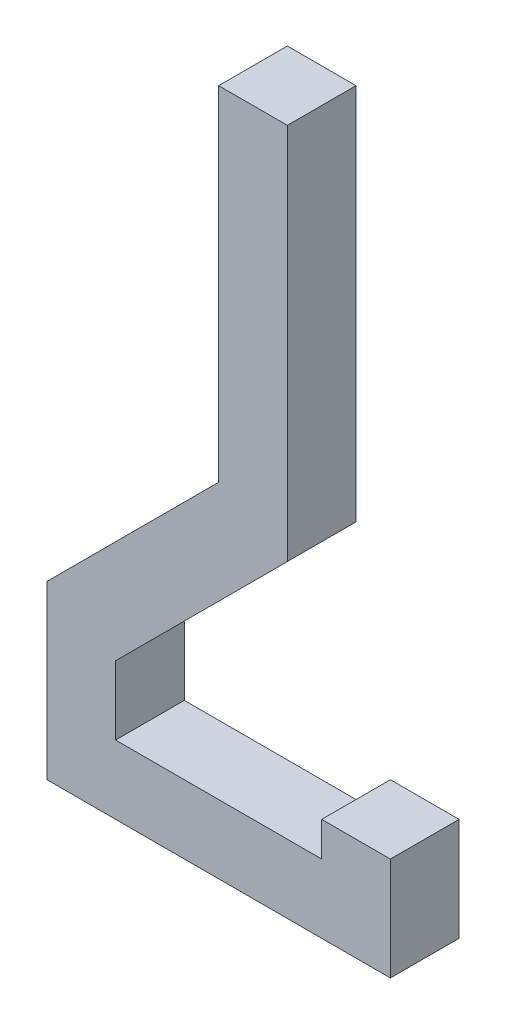
ISO-10303-21;
HEADER;
FILE_DESCRIPTION(('STEP AP214'),'2;1');
FILE_NAME('part.step','',(''),(''),'','','');
FILE_SCHEMA(('AUTOMOTIVE_DESIGN { 1 0 10303 214 1 1 1 1 }'));
ENDSEC;
DATA;
#1=APPLICATION_CONTEXT('core data for automotive mechanical design processes');
#2=APPLICATION_PROTOCOL_DEFINITION('international standard','automotive_design',2000,#1);
#3=PRODUCT_CONTEXT('',#1,'mechanical');
#4=PRODUCT('Part','Part','',(#3));
#5=PRODUCT_RELATED_PRODUCT_CATEGORY('part','',(#4));
#6=PRODUCT_DEFINITION_FORMATION('','',#4);
#7=PRODUCT_DEFINITION_CONTEXT('part definition',#1,'design');
#8=PRODUCT_DEFINITION('design','',#6,#7);
#9=PRODUCT_DEFINITION_SHAPE('','',#8);
#10=(LENGTH_UNIT() NAMED_UNIT(*) SI_UNIT(.MILLI.,.METRE.));
#11=(NAMED_UNIT(*) PLANE_ANGLE_UNIT() SI_UNIT($,.RADIAN.));
#12=(NAMED_UNIT(*) SI_UNIT($,.STERADIAN.) SOLID_ANGLE_UNIT());
#13=UNCERTAINTY_MEASURE_WITH_UNIT(LENGTH_MEASURE(1.E-05),#10,'distance_accuracy_value','');
#14=(GEOMETRIC_REPRESENTATION_CONTEXT(3) GLOBAL_UNCERTAINTY_ASSIGNED_CONTEXT((#13)) GLOBAL_UNIT_ASSIGNED_CONTEXT((#10,
#11,#12)) REPRESENTATION_CONTEXT('',''));
#15=CARTESIAN_POINT('',(0.,0.,0.));
#16=DIRECTION('',(0.,0.,1.));
#17=DIRECTION('',(1.,0.,0.));
#18=AXIS2_PLACEMENT_3D('',#15,#16,#17);
#19=CARTESIAN_POINT('',(0.0635,-0.127,0.0254));
#20=DIRECTION('',(0.,0.,1.));
#21=DIRECTION('',(1.,0.,0.));
#22=AXIS2_PLACEMENT_3D('',#19,#20,#21);
#23=PLANE('',#22);
#24=DIRECTION('',(0.,1.,0.));
#25=VECTOR('',#24,1.);
#26=CARTESIAN_POINT('',(-0.0635,-0.127,0.0254));
#27=LINE('',#26,#25);
#28=CARTESIAN_POINT('',(-0.0635,-0.127,0.0254));
#29=VERTEX_POINT('',#28);
#30=CARTESIAN_POINT('',(-0.0635,-0.0635,0.0254));
#31=VERTEX_POINT('',#30);
#32=EDGE_CURVE('E157',#29,#31,#27,.T.);
#33=ORIENTED_EDGE('',*,*,#32,.F.);
#34=DIRECTION('',(1.,0.,0.));
#35=VECTOR('',#34,1.);
#36=CARTESIAN_POINT('',(0.0635,-0.127,0.0254));
#37=LINE('',#36,#35);
#38=CARTESIAN_POINT('',(0.0635,-0.127,0.0254));
#39=VERTEX_POINT('',#38);
#40=EDGE_CURVE('E118',#39,#29,#37,.F.);
#41=ORIENTED_EDGE('',*,*,#40,.F.);
#42=DIRECTION('',(0.,1.,0.));
#43=VECTOR('',#42,1.);
#44=CARTESIAN_POINT('',(0.0635,-0.08890000000002,0.0254));
#45=LINE('',#44,#43);
#46=CARTESIAN_POINT('',(0.0635,-0.08890000000002,0.0254));
#47=VERTEX_POINT('',#46);
#48=EDGE_CURVE('E20',#47,#39,#45,.F.);
#49=ORIENTED_EDGE('',*,*,#48,.F.);
#50=DIRECTION('',(1.,0.,0.));
#51=VECTOR('',#50,1.);
#52=CARTESIAN_POINT('',(0.0381,-0.08890000000002,0.0254));
#53=LINE('',#52,#51);
#54=CARTESIAN_POINT('',(0.0381,-0.08890000000002,0.0254));
#55=VERTEX_POINT('',#54);
#56=EDGE_CURVE('E107',#55,#47,#53,.T.);
#57=ORIENTED_EDGE('',*,*,#56,.F.);
#58=DIRECTION('',(0.,1.,0.));
#59=VECTOR('',#58,1.);
#60=CARTESIAN_POINT('',(0.0381,-0.1016,0.0254));
#61=LINE('',#60,#59);
#62=CARTESIAN_POINT('',(0.0381,-0.1016,0.0254));
#63=VERTEX_POINT('',#62);
#64=EDGE_CURVE('E102',#63,#55,#61,.T.);
#65=ORIENTED_EDGE('',*,*,#64,.F.);
#66=DIRECTION('',(1.,0.,0.));
#67=VECTOR('',#66,1.);
#68=CARTESIAN_POINT('',(-0.0381,-0.1016,0.0254));
#69=LINE('',#68,#67);
#70=CARTESIAN_POINT('',(-0.0381,-0.1016,0.0254));
#71=VERTEX_POINT('',#70);
#72=EDGE_CURVE('E129',#71,#63,#69,.T.);
#73=ORIENTED_EDGE('',*,*,#72,.F.);
#74=DIRECTION('',(0.,1.,0.));
#75=VECTOR('',#74,1.);
#76=CARTESIAN_POINT('',(-0.0381,-0.0762,0.0254));
#77=LINE('',#76,#75);
#78=CARTESIAN_POINT('',(-0.0381000000000087,-0.0761999999999913,0.0254));
#79=VERTEX_POINT('',#78);
#80=EDGE_CURVE('E133',#79,#71,#77,.F.);
#81=ORIENTED_EDGE('',*,*,#80,.F.);
#82=DIRECTION('',(0.707106781187048,0.707106781186048,0.));
#83=VECTOR('',#82,1.);
#84=CARTESIAN_POINT('',(0.0254,-0.01270000000002,0.0254));
#85=LINE('',#84,#83);
#86=CARTESIAN_POINT('',(0.0254,-0.01270000000002,0.0254));
#87=VERTEX_POINT('',#86);
#88=EDGE_CURVE('E137',#87,#79,#85,.F.);
#89=ORIENTED_EDGE('',*,*,#88,.F.);
#90=DIRECTION('',(0.,1.,0.));
#91=VECTOR('',#90,1.);
#92=CARTESIAN_POINT('',(0.0254,0.127,0.0254));
#93=LINE('',#92,#91);
#94=CARTESIAN_POINT('',(0.0254,0.127,0.0254));
#95=VERTEX_POINT('',#94);
#96=EDGE_CURVE('E141',#95,#87,#93,.F.);
#97=ORIENTED_EDGE('',*,*,#96,.F.);
#98=DIRECTION('',(1.,0.,0.));
#99=VECTOR('',#98,1.);
#100=CARTESIAN_POINT('',(0.,0.127,0.0254));
#101=LINE('',#100,#99);
#102=CARTESIAN_POINT('',(0.,0.127,0.0254));
#103=VERTEX_POINT('',#102);
#104=EDGE_CURVE('E145',#103,#95,#101,.T.);
#105=ORIENTED_EDGE('',*,*,#104,.F.);
#106=DIRECTION('',(0.,1.,0.));
#107=VECTOR('',#106,1.);
#108=CARTESIAN_POINT('',(0.,0.,0.0254));
#109=LINE('',#108,#107);
#110=CARTESIAN_POINT('',(0.,0.,0.0254));
#111=VERTEX_POINT('',#110);
#112=EDGE_CURVE('E149',#111,#103,#109,.T.);
#113=ORIENTED_EDGE('',*,*,#112,.F.);
#114=DIRECTION('',(-0.707106781186548,-0.707106781186548,0.));
#115=VECTOR('',#114,1.);
#116=CARTESIAN_POINT('',(-0.0635,-0.0635,0.0254));
#117=LINE('',#116,#115);
#118=EDGE_CURVE('E153',#31,#111,#117,.F.);
#119=ORIENTED_EDGE('',*,*,#118,.F.);
#120=EDGE_LOOP('',(#33,#41,#49,#57,#65,#73,#81,#89,#97,#105,#113,#119));
#121=FACE_BOUND('',#120,.T.);
#122=ADVANCED_FACE('F17',(#121),#23,.T.);
#123=CARTESIAN_POINT('',(0.0635,-0.08890000000002,0.));
#124=DIRECTION('',(1.,0.,0.));
#125=DIRECTION('',(0.,0.,-1.));
#126=AXIS2_PLACEMENT_3D('',#123,#124,#125);
#127=PLANE('',#126);
#128=DIRECTION('',(0.,0.,-1.));
#129=VECTOR('',#128,1.);
#130=CARTESIAN_POINT('',(0.0635,-0.127,0.));
#131=LINE('',#130,#129);
#132=CARTESIAN_POINT('',(0.0635,-0.127,0.));
#133=VERTEX_POINT('',#132);
#134=EDGE_CURVE('E161',#133,#39,#131,.F.);
#135=ORIENTED_EDGE('',*,*,#134,.F.);
#136=DIRECTION('',(0.,1.,0.));
#137=VECTOR('',#136,1.);
#138=CARTESIAN_POINT('',(0.0635,-0.127,0.));
#139=LINE('',#138,#137);
#140=CARTESIAN_POINT('',(0.0635,-0.08890000000002,0.));
#141=VERTEX_POINT('',#140);
#142=EDGE_CURVE('E124',#133,#141,#139,.T.);
#143=ORIENTED_EDGE('',*,*,#142,.T.);
#144=DIRECTION('',(0.,0.,1.));
#145=VECTOR('',#144,1.);
#146=CARTESIAN_POINT('',(0.0635,-0.08890000000002,0.));
#147=LINE('',#146,#145);
#148=EDGE_CURVE('E112',#47,#141,#147,.F.);
#149=ORIENTED_EDGE('',*,*,#148,.F.);
#150=ORIENTED_EDGE('',*,*,#48,.T.);
#151=EDGE_LOOP('',(#135,#143,#149,#150));
#152=FACE_BOUND('',#151,.T.);
#153=ADVANCED_FACE('F123',(#152),#127,.T.);
#154=CARTESIAN_POINT('',(0.0381,-0.08890000000002,0.));
#155=DIRECTION('',(0.,1.,0.));
#156=DIRECTION('',(0.,0.,1.));
#157=AXIS2_PLACEMENT_3D('',#154,#155,#156);
#158=PLANE('',#157);
#159=ORIENTED_EDGE('',*,*,#148,.T.);
#160=DIRECTION('',(1.,0.,0.));
#161=VECTOR('',#160,1.);
#162=CARTESIAN_POINT('',(0.0635,-0.08890000000002,0.));
#163=LINE('',#162,#161);
#164=CARTESIAN_POINT('',(0.0381,-0.08890000000002,0.));
#165=VERTEX_POINT('',#164);
#166=EDGE_CURVE('E166',#141,#165,#163,.F.);
#167=ORIENTED_EDGE('',*,*,#166,.T.);
#168=DIRECTION('',(0.,0.,1.));
#169=VECTOR('',#168,1.);
#170=CARTESIAN_POINT('',(0.0381,-0.08890000000002,0.));
#171=LINE('',#170,#169);
#172=EDGE_CURVE('E114',#55,#165,#171,.F.);
#173=ORIENTED_EDGE('',*,*,#172,.F.);
#174=ORIENTED_EDGE('',*,*,#56,.T.);
#175=EDGE_LOOP('',(#159,#167,#173,#174));
#176=FACE_BOUND('',#175,.T.);
#177=ADVANCED_FACE('F109',(#176),#158,.T.);
#178=CARTESIAN_POINT('',(0.0381,-0.1016,0.));
#179=DIRECTION('',(-1.,0.,0.));
#180=DIRECTION('',(0.,0.,1.));
#181=AXIS2_PLACEMENT_3D('',#178,#179,#180);
#182=PLANE('',#181);
#183=ORIENTED_EDGE('',*,*,#172,.T.);
#184=DIRECTION('',(0.,1.,0.));
#185=VECTOR('',#184,1.);
#186=CARTESIAN_POINT('',(0.0381,-0.127,0.));
#187=LINE('',#186,#185);
#188=CARTESIAN_POINT('',(0.0381,-0.1016,0.));
#189=VERTEX_POINT('',#188);
#190=EDGE_CURVE('E168',#165,#189,#187,.F.);
#191=ORIENTED_EDGE('',*,*,#190,.T.);
#192=DIRECTION('',(0.,0.,1.));
#193=VECTOR('',#192,1.);
#194=CARTESIAN_POINT('',(0.0381,-0.1016,0.));
#195=LINE('',#194,#193);
#196=EDGE_CURVE('E131',#63,#189,#195,.F.);
#197=ORIENTED_EDGE('',*,*,#196,.F.);
#198=ORIENTED_EDGE('',*,*,#64,.T.);
#199=EDGE_LOOP('',(#183,#191,#197,#198));
#200=FACE_BOUND('',#199,.T.);
#201=ADVANCED_FACE('F234',(#200),#182,.T.);
#202=CARTESIAN_POINT('',(-0.0381,-0.1016,0.));
#203=DIRECTION('',(0.,1.,0.));
#204=DIRECTION('',(0.,0.,1.));
#205=AXIS2_PLACEMENT_3D('',#202,#203,#204);
#206=PLANE('',#205);
#207=ORIENTED_EDGE('',*,*,#196,.T.);
#208=DIRECTION('',(1.,0.,0.));
#209=VECTOR('',#208,1.);
#210=CARTESIAN_POINT('',(0.0635,-0.1016,0.));
#211=LINE('',#210,#209);
#212=CARTESIAN_POINT('',(-0.0381,-0.1016,0.));
#213=VERTEX_POINT('',#212);
#214=EDGE_CURVE('E171',#189,#213,#211,.F.);
#215=ORIENTED_EDGE('',*,*,#214,.T.);
#216=DIRECTION('',(0.,0.,-1.));
#217=VECTOR('',#216,1.);
#218=CARTESIAN_POINT('',(-0.0381,-0.1016,0.));
#219=LINE('',#218,#217);
#220=EDGE_CURVE('E135',#71,#213,#219,.T.);
#221=ORIENTED_EDGE('',*,*,#220,.F.);
#222=ORIENTED_EDGE('',*,*,#72,.T.);
#223=EDGE_LOOP('',(#207,#215,#221,#222));
#224=FACE_BOUND('',#223,.T.);
#225=ADVANCED_FACE('F233',(#224),#206,.T.);
#226=CARTESIAN_POINT('',(-0.0381,-0.0762,0.));
#227=DIRECTION('',(1.,0.,0.));
#228=DIRECTION('',(0.,0.,-1.));
#229=AXIS2_PLACEMENT_3D('',#226,#227,#228);
#230=PLANE('',#229);
#231=ORIENTED_EDGE('',*,*,#220,.T.);
#232=DIRECTION('',(0.,1.,0.));
#233=VECTOR('',#232,1.);
#234=CARTESIAN_POINT('',(-0.0381,-0.127,0.));
#235=LINE('',#234,#233);
#236=CARTESIAN_POINT('',(-0.0381000000000087,-0.0761999999999913,0.));
#237=VERTEX_POINT('',#236);
#238=EDGE_CURVE('E174',#213,#237,#235,.T.);
#239=ORIENTED_EDGE('',*,*,#238,.T.);
#240=DIRECTION('',(0.,0.,1.));
#241=VECTOR('',#240,1.);
#242=CARTESIAN_POINT('',(-0.0381000000000349,-0.0761999999999651,0.));
#243=LINE('',#242,#241);
#244=EDGE_CURVE('E139',#79,#237,#243,.F.);
#245=ORIENTED_EDGE('',*,*,#244,.F.);
#246=ORIENTED_EDGE('',*,*,#80,.T.);
#247=EDGE_LOOP('',(#231,#239,#245,#246));
#248=FACE_BOUND('',#247,.T.);
#249=ADVANCED_FACE('F227',(#248),#230,.T.);
#250=CARTESIAN_POINT('',(0.0254,-0.01270000000002,0.));
#251=DIRECTION('',(0.707106781186048,-0.707106781187048,0.));
#252=DIRECTION('',(0.707106781187048,0.707106781186048,0.));
#253=AXIS2_PLACEMENT_3D('',#250,#251,#252);
#254=PLANE('',#253);
#255=ORIENTED_EDGE('',*,*,#244,.T.);
#256=DIRECTION('',(0.707106781186659,0.707106781186436,0.));
#257=VECTOR('',#256,1.);
#258=CARTESIAN_POINT('',(-0.0381,-0.0762,0.));
#259=LINE('',#258,#257);
#260=CARTESIAN_POINT('',(0.0254,-0.01270000000002,0.));
#261=VERTEX_POINT('',#260);
#262=EDGE_CURVE('E177',#237,#261,#259,.T.);
#263=ORIENTED_EDGE('',*,*,#262,.T.);
#264=DIRECTION('',(0.,0.,-1.));
#265=VECTOR('',#264,1.);
#266=CARTESIAN_POINT('',(0.0254,-0.01270000000002,0.));
#267=LINE('',#266,#265);
#268=EDGE_CURVE('E143',#87,#261,#267,.T.);
#269=ORIENTED_EDGE('',*,*,#268,.F.);
#270=ORIENTED_EDGE('',*,*,#88,.T.);
#271=EDGE_LOOP('',(#255,#263,#269,#270));
#272=FACE_BOUND('',#271,.T.);
#273=ADVANCED_FACE('F223',(#272),#254,.T.);
#274=CARTESIAN_POINT('',(0.0254,0.127,0.));
#275=DIRECTION('',(1.,0.,0.));
#276=DIRECTION('',(0.,0.,-1.));
#277=AXIS2_PLACEMENT_3D('',#274,#275,#276);
#278=PLANE('',#277);
#279=ORIENTED_EDGE('',*,*,#268,.T.);
#280=DIRECTION('',(0.,1.,0.));
#281=VECTOR('',#280,1.);
#282=CARTESIAN_POINT('',(0.0254,-0.127,0.));
#283=LINE('',#282,#281);
#284=CARTESIAN_POINT('',(0.0254,0.127,0.));
#285=VERTEX_POINT('',#284);
#286=EDGE_CURVE('E180',#261,#285,#283,.T.);
#287=ORIENTED_EDGE('',*,*,#286,.T.);
#288=DIRECTION('',(0.,0.,1.));
#289=VECTOR('',#288,1.);
#290=CARTESIAN_POINT('',(0.0254,0.127,0.));
#291=LINE('',#290,#289);
#292=EDGE_CURVE('E147',#95,#285,#291,.F.);
#293=ORIENTED_EDGE('',*,*,#292,.F.);
#294=ORIENTED_EDGE('',*,*,#96,.T.);
#295=EDGE_LOOP('',(#279,#287,#293,#294));
#296=FACE_BOUND('',#295,.T.);
#297=ADVANCED_FACE('F217',(#296),#278,.T.);
#298=CARTESIAN_POINT('',(0.,0.127,0.));
#299=DIRECTION('',(0.,1.,0.));
#300=DIRECTION('',(0.,0.,1.));
#301=AXIS2_PLACEMENT_3D('',#298,#299,#300);
#302=PLANE('',#301);
#303=ORIENTED_EDGE('',*,*,#292,.T.);
#304=DIRECTION('',(1.,0.,0.));
#305=VECTOR('',#304,1.);
#306=CARTESIAN_POINT('',(0.0635,0.127,0.));
#307=LINE('',#306,#305);
#308=CARTESIAN_POINT('',(0.,0.127,0.));
#309=VERTEX_POINT('',#308);
#310=EDGE_CURVE('E183',#285,#309,#307,.F.);
#311=ORIENTED_EDGE('',*,*,#310,.T.);
#312=DIRECTION('',(0.,0.,1.));
#313=VECTOR('',#312,1.);
#314=CARTESIAN_POINT('',(0.,0.127,0.));
#315=LINE('',#314,#313);
#316=EDGE_CURVE('E151',#103,#309,#315,.F.);
#317=ORIENTED_EDGE('',*,*,#316,.F.);
#318=ORIENTED_EDGE('',*,*,#104,.T.);
#319=EDGE_LOOP('',(#303,#311,#317,#318));
#320=FACE_BOUND('',#319,.T.);
#321=ADVANCED_FACE('F213',(#320),#302,.T.);
#322=CARTESIAN_POINT('',(0.,0.,0.));
#323=DIRECTION('',(-1.,0.,0.));
#324=DIRECTION('',(0.,0.,1.));
#325=AXIS2_PLACEMENT_3D('',#322,#323,#324);
#326=PLANE('',#325);
#327=ORIENTED_EDGE('',*,*,#316,.T.);
#328=DIRECTION('',(0.,1.,0.));
#329=VECTOR('',#328,1.);
#330=CARTESIAN_POINT('',(0.,-0.127,0.));
#331=LINE('',#330,#329);
#332=CARTESIAN_POINT('',(0.,0.,0.));
#333=VERTEX_POINT('',#332);
#334=EDGE_CURVE('E186',#309,#333,#331,.F.);
#335=ORIENTED_EDGE('',*,*,#334,.T.);
#336=DIRECTION('',(0.,0.,1.));
#337=VECTOR('',#336,1.);
#338=CARTESIAN_POINT('',(0.,0.,0.));
#339=LINE('',#338,#337);
#340=EDGE_CURVE('E155',#111,#333,#339,.F.);
#341=ORIENTED_EDGE('',*,*,#340,.F.);
#342=ORIENTED_EDGE('',*,*,#112,.T.);
#343=EDGE_LOOP('',(#327,#335,#341,#342));
#344=FACE_BOUND('',#343,.T.);
#345=ADVANCED_FACE('F207',(#344),#326,.T.);
#346=CARTESIAN_POINT('',(-0.0635,-0.0635,0.));
#347=DIRECTION('',(-0.707106781186548,0.707106781186548,0.));
#348=DIRECTION('',(-0.707106781186548,-0.707106781186548,0.));
#349=AXIS2_PLACEMENT_3D('',#346,#347,#348);
#350=PLANE('',#349);
#351=ORIENTED_EDGE('',*,*,#340,.T.);
#352=DIRECTION('',(-0.707106781186548,-0.707106781186548,0.));
#353=VECTOR('',#352,1.);
#354=CARTESIAN_POINT('',(0.,0.,0.));
#355=LINE('',#354,#353);
#356=CARTESIAN_POINT('',(-0.0635,-0.0635,0.));
#357=VERTEX_POINT('',#356);
#358=EDGE_CURVE('E189',#333,#357,#355,.T.);
#359=ORIENTED_EDGE('',*,*,#358,.T.);
#360=DIRECTION('',(0.,0.,1.));
#361=VECTOR('',#360,1.);
#362=CARTESIAN_POINT('',(-0.0635,-0.0635,0.));
#363=LINE('',#362,#361);
#364=EDGE_CURVE('E159',#31,#357,#363,.F.);
#365=ORIENTED_EDGE('',*,*,#364,.F.);
#366=ORIENTED_EDGE('',*,*,#118,.T.);
#367=EDGE_LOOP('',(#351,#359,#365,#366));
#368=FACE_BOUND('',#367,.T.);
#369=ADVANCED_FACE('F202',(#368),#350,.T.);
#370=CARTESIAN_POINT('',(-0.0635,-0.127,0.));
#371=DIRECTION('',(-1.,0.,0.));
#372=DIRECTION('',(0.,0.,1.));
#373=AXIS2_PLACEMENT_3D('',#370,#371,#372);
#374=PLANE('',#373);
#375=ORIENTED_EDGE('',*,*,#364,.T.);
#376=DIRECTION('',(0.,1.,0.));
#377=VECTOR('',#376,1.);
#378=CARTESIAN_POINT('',(-0.0635,-0.127,0.));
#379=LINE('',#378,#377);
#380=CARTESIAN_POINT('',(-0.0635,-0.127,0.));
#381=VERTEX_POINT('',#380);
#382=EDGE_CURVE('E26',#357,#381,#379,.F.);
#383=ORIENTED_EDGE('',*,*,#382,.T.);
#384=DIRECTION('',(0.,0.,-1.));
#385=VECTOR('',#384,1.);
#386=CARTESIAN_POINT('',(-0.0635,-0.127,0.));
#387=LINE('',#386,#385);
#388=EDGE_CURVE('E34',#29,#381,#387,.T.);
#389=ORIENTED_EDGE('',*,*,#388,.F.);
#390=ORIENTED_EDGE('',*,*,#32,.T.);
#391=EDGE_LOOP('',(#375,#383,#389,#390));
#392=FACE_BOUND('',#391,.T.);
#393=ADVANCED_FACE('F195',(#392),#374,.T.);
#394=CARTESIAN_POINT('',(0.0635,-0.127,0.));
#395=DIRECTION('',(0.,-1.,0.));
#396=DIRECTION('',(0.,0.,-1.));
#397=AXIS2_PLACEMENT_3D('',#394,#395,#396);
#398=PLANE('',#397);
#399=ORIENTED_EDGE('',*,*,#388,.T.);
#400=DIRECTION('',(1.,0.,0.));
#401=VECTOR('',#400,1.);
#402=CARTESIAN_POINT('',(0.0635,-0.127,0.));
#403=LINE('',#402,#401);
#404=EDGE_CURVE('E11',#381,#133,#403,.T.);
#405=ORIENTED_EDGE('',*,*,#404,.T.);
#406=ORIENTED_EDGE('',*,*,#134,.T.);
#407=ORIENTED_EDGE('',*,*,#40,.T.);
#408=EDGE_LOOP('',(#399,#405,#406,#407));
#409=FACE_BOUND('',#408,.T.);
#410=ADVANCED_FACE('F235',(#409),#398,.T.);
#411=CARTESIAN_POINT('',(0.0635,-0.127,0.));
#412=DIRECTION('',(0.,0.,1.));
#413=DIRECTION('',(1.,0.,0.));
#414=AXIS2_PLACEMENT_3D('',#411,#412,#413);
#415=PLANE('',#414);
#416=ORIENTED_EDGE('',*,*,#382,.F.);
#417=ORIENTED_EDGE('',*,*,#358,.F.);
#418=ORIENTED_EDGE('',*,*,#334,.F.);
#419=ORIENTED_EDGE('',*,*,#310,.F.);
#420=ORIENTED_EDGE('',*,*,#286,.F.);
#421=ORIENTED_EDGE('',*,*,#262,.F.);
#422=ORIENTED_EDGE('',*,*,#238,.F.);
#423=ORIENTED_EDGE('',*,*,#214,.F.);
#424=ORIENTED_EDGE('',*,*,#190,.F.);
#425=ORIENTED_EDGE('',*,*,#166,.F.);
#426=ORIENTED_EDGE('',*,*,#142,.F.);
#427=ORIENTED_EDGE('',*,*,#404,.F.);
#428=EDGE_LOOP('',(#416,#417,#418,#419,#420,#421,#422,#423,#424,#425,#426,#427));
#429=FACE_BOUND('',#428,.T.);
#430=ADVANCED_FACE('F199',(#429),#415,.F.);
#431=CLOSED_SHELL('',(#122,#153,#177,#201,#225,#249,#273,#297,#321,#345,#369,#393,#410,#430));
#432=MANIFOLD_SOLID_BREP('B1',#431);
#433=ADVANCED_BREP_SHAPE_REPRESENTATION('',(#18,#432),#14);
#434=SHAPE_DEFINITION_REPRESENTATION(#9,#433);
ENDSEC;
END-ISO-10303-21;
